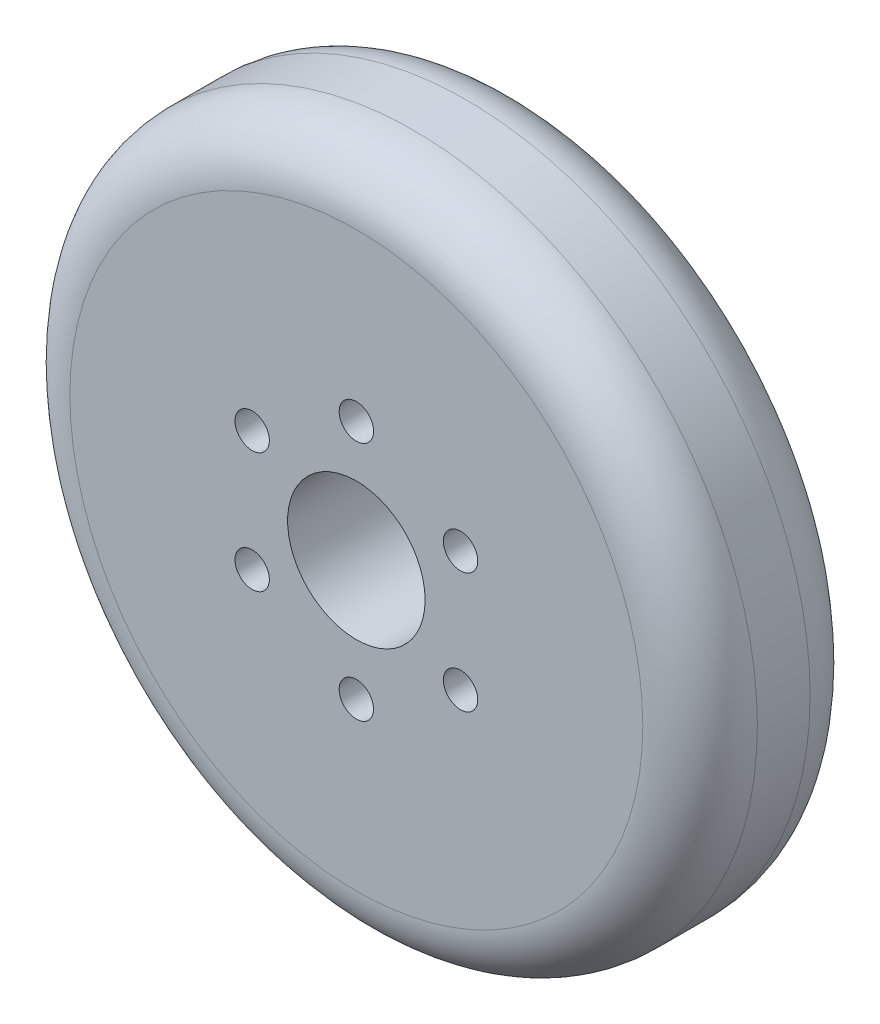
ISO-10303-21;
HEADER;
FILE_DESCRIPTION(('STEP AP214'),'2;1');
FILE_NAME('part.step','',(''),(''),'','','');
FILE_SCHEMA(('AUTOMOTIVE_DESIGN { 1 0 10303 214 1 1 1 1 }'));
ENDSEC;
DATA;
#1=APPLICATION_CONTEXT('core data for automotive mechanical design processes');
#2=APPLICATION_PROTOCOL_DEFINITION('international standard','automotive_design',2000,#1);
#3=PRODUCT_CONTEXT('',#1,'mechanical');
#4=PRODUCT('Part','Part','',(#3));
#5=PRODUCT_RELATED_PRODUCT_CATEGORY('part','',(#4));
#6=PRODUCT_DEFINITION_FORMATION('','',#4);
#7=PRODUCT_DEFINITION_CONTEXT('part definition',#1,'design');
#8=PRODUCT_DEFINITION('design','',#6,#7);
#9=PRODUCT_DEFINITION_SHAPE('','',#8);
#10=(LENGTH_UNIT() NAMED_UNIT(*) SI_UNIT(.MILLI.,.METRE.));
#11=(NAMED_UNIT(*) PLANE_ANGLE_UNIT() SI_UNIT($,.RADIAN.));
#12=(NAMED_UNIT(*) SI_UNIT($,.STERADIAN.) SOLID_ANGLE_UNIT());
#13=UNCERTAINTY_MEASURE_WITH_UNIT(LENGTH_MEASURE(1.E-05),#10,'distance_accuracy_value','');
#14=(GEOMETRIC_REPRESENTATION_CONTEXT(3) GLOBAL_UNCERTAINTY_ASSIGNED_CONTEXT((#13)) GLOBAL_UNIT_ASSIGNED_CONTEXT((#10,
#11,#12)) REPRESENTATION_CONTEXT('',''));
#15=CARTESIAN_POINT('',(0.,0.,0.));
#16=DIRECTION('',(0.,0.,1.));
#17=DIRECTION('',(1.,0.,0.));
#18=AXIS2_PLACEMENT_3D('',#15,#16,#17);
#19=CARTESIAN_POINT('',(0.,0.,14.6));
#20=DIRECTION('',(0.,0.,1.));
#21=DIRECTION('',(1.,0.,0.));
#22=AXIS2_PLACEMENT_3D('',#19,#20,#21);
#23=PLANE('',#22);
#24=CARTESIAN_POINT('',(-9.09326673973655,5.25000000000011,14.6));
#25=DIRECTION('',(0.,0.,-1.));
#26=DIRECTION('',(-0.50000000000001,-0.866025403784433,0.));
#27=AXIS2_PLACEMENT_3D('',#24,#25,#26);
#28=CIRCLE('',#27,1.5);
#29=CARTESIAN_POINT('',(-9.84326673973656,3.95096189432346,14.6));
#30=VERTEX_POINT('',#29);
#31=EDGE_CURVE('E79',#30,#30,#28,.T.);
#32=ORIENTED_EDGE('',*,*,#31,.T.);
#33=EDGE_LOOP('',(#32));
#34=FACE_BOUND('',#33,.T.);
#35=CARTESIAN_POINT('',(-9.09326673973665,-5.24999999999992,14.6));
#36=DIRECTION('',(0.,0.,-1.));
#37=DIRECTION('',(0.499999999999992,-0.866025403784443,0.));
#38=AXIS2_PLACEMENT_3D('',#35,#36,#37);
#39=CIRCLE('',#38,1.5);
#40=CARTESIAN_POINT('',(-8.34326673973667,-6.54903810567658,14.6));
#41=VERTEX_POINT('',#40);
#42=EDGE_CURVE('E85',#41,#41,#39,.T.);
#43=ORIENTED_EDGE('',*,*,#42,.T.);
#44=EDGE_LOOP('',(#43));
#45=FACE_BOUND('',#44,.T.);
#46=CARTESIAN_POINT('',(0.,-10.5,14.6));
#47=DIRECTION('',(0.,0.,-1.));
#48=DIRECTION('',(1.,0.,0.));
#49=AXIS2_PLACEMENT_3D('',#46,#47,#48);
#50=CIRCLE('',#49,1.5);
#51=CARTESIAN_POINT('',(1.5,-10.5,14.6));
#52=VERTEX_POINT('',#51);
#53=EDGE_CURVE('E91',#52,#52,#50,.T.);
#54=ORIENTED_EDGE('',*,*,#53,.T.);
#55=EDGE_LOOP('',(#54));
#56=FACE_BOUND('',#55,.T.);
#57=CARTESIAN_POINT('',(9.09326673973658,-5.25000000000004,14.6));
#58=DIRECTION('',(0.,0.,-1.));
#59=DIRECTION('',(0.500000000000004,0.866025403784436,0.));
#60=AXIS2_PLACEMENT_3D('',#57,#58,#59);
#61=CIRCLE('',#60,1.5);
#62=CARTESIAN_POINT('',(9.84326673973659,-3.95096189432339,14.6));
#63=VERTEX_POINT('',#62);
#64=EDGE_CURVE('E73',#63,#63,#61,.T.);
#65=ORIENTED_EDGE('',*,*,#64,.T.);
#66=EDGE_LOOP('',(#65));
#67=FACE_BOUND('',#66,.T.);
#68=CARTESIAN_POINT('',(9.09326673973662,5.24999999999998,14.6));
#69=DIRECTION('',(0.,0.,-1.));
#70=DIRECTION('',(-0.499999999999998,0.86602540378444,0.));
#71=AXIS2_PLACEMENT_3D('',#68,#69,#70);
#72=CIRCLE('',#71,1.5);
#73=CARTESIAN_POINT('',(8.34326673973662,6.54903810567664,14.6));
#74=VERTEX_POINT('',#73);
#75=EDGE_CURVE('E67',#74,#74,#72,.T.);
#76=ORIENTED_EDGE('',*,*,#75,.T.);
#77=EDGE_LOOP('',(#76));
#78=FACE_BOUND('',#77,.T.);
#79=CARTESIAN_POINT('',(0.,10.5,14.6));
#80=DIRECTION('',(0.,0.,-1.));
#81=DIRECTION('',(-1.,0.,0.));
#82=AXIS2_PLACEMENT_3D('',#79,#80,#81);
#83=CIRCLE('',#82,1.5);
#84=CARTESIAN_POINT('',(-1.5,10.5,14.6));
#85=VERTEX_POINT('',#84);
#86=EDGE_CURVE('E61',#85,#85,#83,.T.);
#87=ORIENTED_EDGE('',*,*,#86,.T.);
#88=EDGE_LOOP('',(#87));
#89=FACE_BOUND('',#88,.T.);
#90=CARTESIAN_POINT('',(0.,0.,14.6));
#91=DIRECTION('',(0.,0.,1.));
#92=DIRECTION('',(1.,0.,0.));
#93=AXIS2_PLACEMENT_3D('',#90,#91,#92);
#94=CIRCLE('',#93,25.);
#95=CARTESIAN_POINT('',(25.,0.,14.6));
#96=VERTEX_POINT('',#95);
#97=EDGE_CURVE('E52',#96,#96,#94,.T.);
#98=ORIENTED_EDGE('',*,*,#97,.T.);
#99=EDGE_LOOP('',(#98));
#100=FACE_BOUND('',#99,.T.);
#101=CARTESIAN_POINT('',(0.,0.,14.6));
#102=DIRECTION('',(0.,0.,1.));
#103=DIRECTION('',(1.,0.,0.));
#104=AXIS2_PLACEMENT_3D('',#101,#102,#103);
#105=CIRCLE('',#104,6.);
#106=CARTESIAN_POINT('',(6.,0.,14.6));
#107=VERTEX_POINT('',#106);
#108=EDGE_CURVE('E57',#107,#107,#105,.T.);
#109=ORIENTED_EDGE('',*,*,#108,.F.);
#110=EDGE_LOOP('',(#109));
#111=FACE_BOUND('',#110,.T.);
#112=ADVANCED_FACE('F37',(#34,#45,#56,#67,#78,#89,#100,#111),#23,.T.);
#113=CARTESIAN_POINT('',(0.,0.,0.));
#114=DIRECTION('',(0.,0.,1.));
#115=DIRECTION('',(1.,0.,0.));
#116=AXIS2_PLACEMENT_3D('',#113,#114,#115);
#117=PLANE('',#116);
#118=CARTESIAN_POINT('',(-9.09326673973655,5.25000000000011,0.));
#119=DIRECTION('',(0.,0.,-1.));
#120=DIRECTION('',(-0.50000000000001,-0.866025403784433,0.));
#121=AXIS2_PLACEMENT_3D('',#118,#119,#120);
#122=CIRCLE('',#121,1.5);
#123=CARTESIAN_POINT('',(-9.84326673973656,3.95096189432346,0.));
#124=VERTEX_POINT('',#123);
#125=EDGE_CURVE('E76',#124,#124,#122,.T.);
#126=ORIENTED_EDGE('',*,*,#125,.F.);
#127=EDGE_LOOP('',(#126));
#128=FACE_BOUND('',#127,.T.);
#129=CARTESIAN_POINT('',(-9.09326673973665,-5.24999999999992,0.));
#130=DIRECTION('',(0.,0.,-1.));
#131=DIRECTION('',(0.499999999999992,-0.866025403784443,0.));
#132=AXIS2_PLACEMENT_3D('',#129,#130,#131);
#133=CIRCLE('',#132,1.5);
#134=CARTESIAN_POINT('',(-8.34326673973667,-6.54903810567658,0.));
#135=VERTEX_POINT('',#134);
#136=EDGE_CURVE('E82',#135,#135,#133,.T.);
#137=ORIENTED_EDGE('',*,*,#136,.F.);
#138=EDGE_LOOP('',(#137));
#139=FACE_BOUND('',#138,.T.);
#140=CARTESIAN_POINT('',(0.,-10.5,0.));
#141=DIRECTION('',(0.,0.,-1.));
#142=DIRECTION('',(1.,0.,0.));
#143=AXIS2_PLACEMENT_3D('',#140,#141,#142);
#144=CIRCLE('',#143,1.5);
#145=CARTESIAN_POINT('',(1.5,-10.5,0.));
#146=VERTEX_POINT('',#145);
#147=EDGE_CURVE('E88',#146,#146,#144,.T.);
#148=ORIENTED_EDGE('',*,*,#147,.F.);
#149=EDGE_LOOP('',(#148));
#150=FACE_BOUND('',#149,.T.);
#151=CARTESIAN_POINT('',(9.09326673973658,-5.25000000000004,0.));
#152=DIRECTION('',(0.,0.,-1.));
#153=DIRECTION('',(0.500000000000004,0.866025403784436,0.));
#154=AXIS2_PLACEMENT_3D('',#151,#152,#153);
#155=CIRCLE('',#154,1.5);
#156=CARTESIAN_POINT('',(9.84326673973659,-3.95096189432339,0.));
#157=VERTEX_POINT('',#156);
#158=EDGE_CURVE('E94',#157,#157,#155,.T.);
#159=ORIENTED_EDGE('',*,*,#158,.F.);
#160=EDGE_LOOP('',(#159));
#161=FACE_BOUND('',#160,.T.);
#162=CARTESIAN_POINT('',(9.09326673973662,5.24999999999998,0.));
#163=DIRECTION('',(0.,0.,-1.));
#164=DIRECTION('',(-0.499999999999998,0.86602540378444,0.));
#165=AXIS2_PLACEMENT_3D('',#162,#163,#164);
#166=CIRCLE('',#165,1.5);
#167=CARTESIAN_POINT('',(8.34326673973662,6.54903810567664,0.));
#168=VERTEX_POINT('',#167);
#169=EDGE_CURVE('E70',#168,#168,#166,.T.);
#170=ORIENTED_EDGE('',*,*,#169,.F.);
#171=EDGE_LOOP('',(#170));
#172=FACE_BOUND('',#171,.T.);
#173=CARTESIAN_POINT('',(0.,10.5,0.));
#174=DIRECTION('',(0.,0.,-1.));
#175=DIRECTION('',(-1.,0.,0.));
#176=AXIS2_PLACEMENT_3D('',#173,#174,#175);
#177=CIRCLE('',#176,1.5);
#178=CARTESIAN_POINT('',(-1.5,10.5,0.));
#179=VERTEX_POINT('',#178);
#180=EDGE_CURVE('E64',#179,#179,#177,.T.);
#181=ORIENTED_EDGE('',*,*,#180,.F.);
#182=EDGE_LOOP('',(#181));
#183=FACE_BOUND('',#182,.T.);
#184=CARTESIAN_POINT('',(0.,0.,0.));
#185=DIRECTION('',(0.,0.,1.));
#186=DIRECTION('',(1.,0.,0.));
#187=AXIS2_PLACEMENT_3D('',#184,#185,#186);
#188=CIRCLE('',#187,25.);
#189=CARTESIAN_POINT('',(25.,0.,0.));
#190=VERTEX_POINT('',#189);
#191=EDGE_CURVE('E10',#190,#190,#188,.F.);
#192=ORIENTED_EDGE('',*,*,#191,.T.);
#193=EDGE_LOOP('',(#192));
#194=FACE_BOUND('',#193,.T.);
#195=CARTESIAN_POINT('',(0.,0.,0.));
#196=DIRECTION('',(0.,0.,1.));
#197=DIRECTION('',(1.,0.,0.));
#198=AXIS2_PLACEMENT_3D('',#195,#196,#197);
#199=CIRCLE('',#198,6.);
#200=CARTESIAN_POINT('',(6.,0.,0.));
#201=VERTEX_POINT('',#200);
#202=EDGE_CURVE('E58',#201,#201,#199,.T.);
#203=ORIENTED_EDGE('',*,*,#202,.T.);
#204=EDGE_LOOP('',(#203));
#205=FACE_BOUND('',#204,.T.);
#206=ADVANCED_FACE('F110',(#128,#139,#150,#161,#172,#183,#194,#205),#117,.F.);
#207=CARTESIAN_POINT('',(0.,0.,14.6));
#208=DIRECTION('',(0.,0.,-1.));
#209=DIRECTION('',(-1.,0.,0.));
#210=AXIS2_PLACEMENT_3D('',#207,#208,#209);
#211=CYLINDRICAL_SURFACE('',#210,30.);
#212=CARTESIAN_POINT('',(0.,0.,9.6));
#213=DIRECTION('',(0.,0.,1.));
#214=DIRECTION('',(1.,0.,0.));
#215=AXIS2_PLACEMENT_3D('',#212,#213,#214);
#216=CIRCLE('',#215,30.);
#217=CARTESIAN_POINT('',(30.,0.,9.6));
#218=VERTEX_POINT('',#217);
#219=EDGE_CURVE('E44',#218,#218,#216,.F.);
#220=ORIENTED_EDGE('',*,*,#219,.T.);
#221=EDGE_LOOP('',(#220));
#222=FACE_BOUND('',#221,.T.);
#223=CARTESIAN_POINT('',(0.,0.,5.));
#224=DIRECTION('',(0.,0.,1.));
#225=DIRECTION('',(1.,0.,0.));
#226=AXIS2_PLACEMENT_3D('',#223,#224,#225);
#227=CIRCLE('',#226,30.);
#228=CARTESIAN_POINT('',(30.,0.,5.));
#229=VERTEX_POINT('',#228);
#230=EDGE_CURVE('E48',#229,#229,#227,.T.);
#231=ORIENTED_EDGE('',*,*,#230,.T.);
#232=EDGE_LOOP('',(#231));
#233=FACE_BOUND('',#232,.T.);
#234=ADVANCED_FACE('F113',(#222,#233),#211,.T.);
#235=CARTESIAN_POINT('',(0.,0.,14.6));
#236=DIRECTION('',(0.,0.,-1.));
#237=DIRECTION('',(-1.,0.,0.));
#238=AXIS2_PLACEMENT_3D('',#235,#236,#237);
#239=CYLINDRICAL_SURFACE('',#238,6.);
#240=ORIENTED_EDGE('',*,*,#108,.T.);
#241=EDGE_LOOP('',(#240));
#242=FACE_BOUND('',#241,.T.);
#243=ORIENTED_EDGE('',*,*,#202,.F.);
#244=EDGE_LOOP('',(#243));
#245=FACE_BOUND('',#244,.T.);
#246=ADVANCED_FACE('F122',(#242,#245),#239,.F.);
#247=CARTESIAN_POINT('',(0.,0.,9.6));
#248=DIRECTION('',(0.,0.,1.));
#249=DIRECTION('',(1.,0.,0.));
#250=AXIS2_PLACEMENT_3D('',#247,#248,#249);
#251=TOROIDAL_SURFACE('',#250,25.,5.);
#252=ORIENTED_EDGE('',*,*,#219,.F.);
#253=EDGE_LOOP('',(#252));
#254=FACE_BOUND('',#253,.T.);
#255=ORIENTED_EDGE('',*,*,#97,.F.);
#256=EDGE_LOOP('',(#255));
#257=FACE_BOUND('',#256,.T.);
#258=ADVANCED_FACE('F124',(#254,#257),#251,.T.);
#259=CARTESIAN_POINT('',(0.,0.,5.));
#260=DIRECTION('',(0.,0.,1.));
#261=DIRECTION('',(1.,0.,0.));
#262=AXIS2_PLACEMENT_3D('',#259,#260,#261);
#263=TOROIDAL_SURFACE('',#262,25.,5.);
#264=ORIENTED_EDGE('',*,*,#191,.F.);
#265=EDGE_LOOP('',(#264));
#266=FACE_BOUND('',#265,.T.);
#267=ORIENTED_EDGE('',*,*,#230,.F.);
#268=EDGE_LOOP('',(#267));
#269=FACE_BOUND('',#268,.T.);
#270=ADVANCED_FACE('F39',(#266,#269),#263,.T.);
#271=CARTESIAN_POINT('',(0.,10.5,14.6));
#272=DIRECTION('',(0.,0.,-1.));
#273=DIRECTION('',(-1.,0.,0.));
#274=AXIS2_PLACEMENT_3D('',#271,#272,#273);
#275=CYLINDRICAL_SURFACE('',#274,1.5);
#276=ORIENTED_EDGE('',*,*,#86,.F.);
#277=EDGE_LOOP('',(#276));
#278=FACE_BOUND('',#277,.T.);
#279=ORIENTED_EDGE('',*,*,#180,.T.);
#280=EDGE_LOOP('',(#279));
#281=FACE_BOUND('',#280,.T.);
#282=ADVANCED_FACE('F163',(#278,#281),#275,.F.);
#283=CARTESIAN_POINT('',(9.09326673973662,5.24999999999998,14.6));
#284=DIRECTION('',(0.,0.,-1.));
#285=DIRECTION('',(-1.,0.,0.));
#286=AXIS2_PLACEMENT_3D('',#283,#284,#285);
#287=CYLINDRICAL_SURFACE('',#286,1.5);
#288=ORIENTED_EDGE('',*,*,#75,.F.);
#289=EDGE_LOOP('',(#288));
#290=FACE_BOUND('',#289,.T.);
#291=ORIENTED_EDGE('',*,*,#169,.T.);
#292=EDGE_LOOP('',(#291));
#293=FACE_BOUND('',#292,.T.);
#294=ADVANCED_FACE('F106',(#290,#293),#287,.F.);
#295=CARTESIAN_POINT('',(9.09326673973658,-5.25000000000004,14.6));
#296=DIRECTION('',(0.,0.,-1.));
#297=DIRECTION('',(-1.,0.,0.));
#298=AXIS2_PLACEMENT_3D('',#295,#296,#297);
#299=CYLINDRICAL_SURFACE('',#298,1.5);
#300=ORIENTED_EDGE('',*,*,#64,.F.);
#301=EDGE_LOOP('',(#300));
#302=FACE_BOUND('',#301,.T.);
#303=ORIENTED_EDGE('',*,*,#158,.T.);
#304=EDGE_LOOP('',(#303));
#305=FACE_BOUND('',#304,.T.);
#306=ADVANCED_FACE('F102',(#302,#305),#299,.F.);
#307=CARTESIAN_POINT('',(0.,-10.5,14.6));
#308=DIRECTION('',(0.,0.,-1.));
#309=DIRECTION('',(-1.,0.,0.));
#310=AXIS2_PLACEMENT_3D('',#307,#308,#309);
#311=CYLINDRICAL_SURFACE('',#310,1.5);
#312=ORIENTED_EDGE('',*,*,#53,.F.);
#313=EDGE_LOOP('',(#312));
#314=FACE_BOUND('',#313,.T.);
#315=ORIENTED_EDGE('',*,*,#147,.T.);
#316=EDGE_LOOP('',(#315));
#317=FACE_BOUND('',#316,.T.);
#318=ADVANCED_FACE('F105',(#314,#317),#311,.F.);
#319=CARTESIAN_POINT('',(-9.09326673973665,-5.24999999999992,14.6));
#320=DIRECTION('',(0.,0.,-1.));
#321=DIRECTION('',(-1.,0.,0.));
#322=AXIS2_PLACEMENT_3D('',#319,#320,#321);
#323=CYLINDRICAL_SURFACE('',#322,1.5);
#324=ORIENTED_EDGE('',*,*,#42,.F.);
#325=EDGE_LOOP('',(#324));
#326=FACE_BOUND('',#325,.T.);
#327=ORIENTED_EDGE('',*,*,#136,.T.);
#328=EDGE_LOOP('',(#327));
#329=FACE_BOUND('',#328,.T.);
#330=ADVANCED_FACE('F148',(#326,#329),#323,.F.);
#331=CARTESIAN_POINT('',(-9.09326673973655,5.25000000000011,14.6));
#332=DIRECTION('',(0.,0.,-1.));
#333=DIRECTION('',(-1.,0.,0.));
#334=AXIS2_PLACEMENT_3D('',#331,#332,#333);
#335=CYLINDRICAL_SURFACE('',#334,1.5);
#336=ORIENTED_EDGE('',*,*,#31,.F.);
#337=EDGE_LOOP('',(#336));
#338=FACE_BOUND('',#337,.T.);
#339=ORIENTED_EDGE('',*,*,#125,.T.);
#340=EDGE_LOOP('',(#339));
#341=FACE_BOUND('',#340,.T.);
#342=ADVANCED_FACE('F155',(#338,#341),#335,.F.);
#343=CLOSED_SHELL('',(#112,#206,#234,#246,#258,#270,#282,#294,#306,#318,#330,#342));
#344=MANIFOLD_SOLID_BREP('B2',#343);
#345=ADVANCED_BREP_SHAPE_REPRESENTATION('',(#18,#344),#14);
#346=SHAPE_DEFINITION_REPRESENTATION(#9,#345);
ENDSEC;
END-ISO-10303-21;
